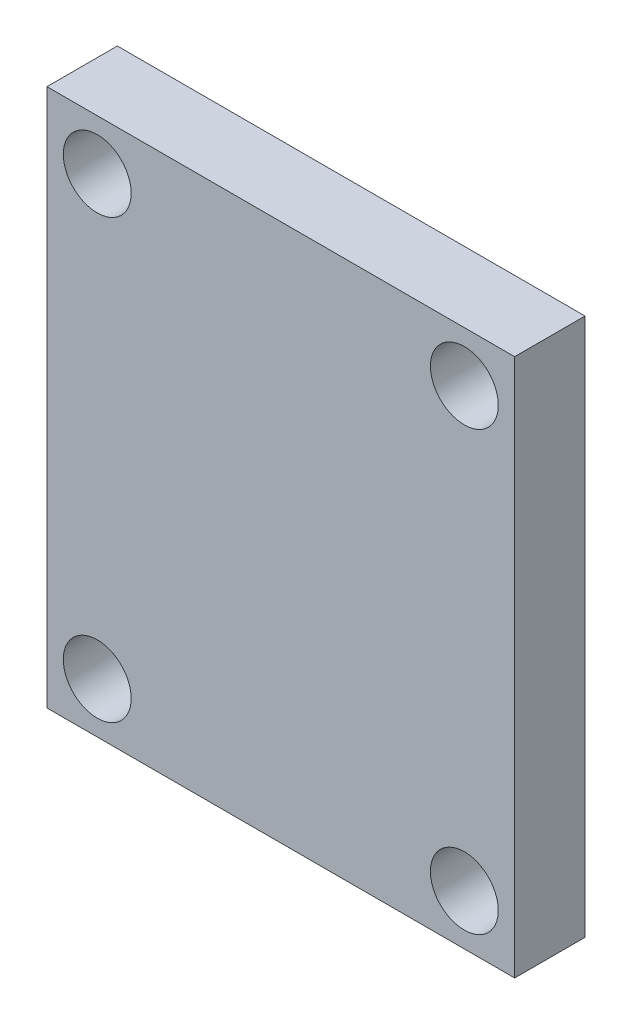
ISO-10303-21;
HEADER;
FILE_DESCRIPTION(('STEP AP214'),'2;1');
FILE_NAME('part.step','',(''),(''),'','','');
FILE_SCHEMA(('AUTOMOTIVE_DESIGN { 1 0 10303 214 1 1 1 1 }'));
ENDSEC;
DATA;
#1=APPLICATION_CONTEXT('core data for automotive mechanical design processes');
#2=APPLICATION_PROTOCOL_DEFINITION('international standard','automotive_design',2000,#1);
#3=PRODUCT_CONTEXT('',#1,'mechanical');
#4=PRODUCT('Part','Part','',(#3));
#5=PRODUCT_RELATED_PRODUCT_CATEGORY('part','',(#4));
#6=PRODUCT_DEFINITION_FORMATION('','',#4);
#7=PRODUCT_DEFINITION_CONTEXT('part definition',#1,'design');
#8=PRODUCT_DEFINITION('design','',#6,#7);
#9=PRODUCT_DEFINITION_SHAPE('','',#8);
#10=(LENGTH_UNIT() NAMED_UNIT(*) SI_UNIT(.MILLI.,.METRE.));
#11=(NAMED_UNIT(*) PLANE_ANGLE_UNIT() SI_UNIT($,.RADIAN.));
#12=(NAMED_UNIT(*) SI_UNIT($,.STERADIAN.) SOLID_ANGLE_UNIT());
#13=UNCERTAINTY_MEASURE_WITH_UNIT(LENGTH_MEASURE(1.E-05),#10,'distance_accuracy_value','');
#14=(GEOMETRIC_REPRESENTATION_CONTEXT(3) GLOBAL_UNCERTAINTY_ASSIGNED_CONTEXT((#13)) GLOBAL_UNIT_ASSIGNED_CONTEXT((#10,
#11,#12)) REPRESENTATION_CONTEXT('',''));
#15=CARTESIAN_POINT('',(0.,0.,0.));
#16=DIRECTION('',(0.,0.,1.));
#17=DIRECTION('',(1.,0.,0.));
#18=AXIS2_PLACEMENT_3D('',#15,#16,#17);
#19=CARTESIAN_POINT('',(46.5,-53.5,14.));
#20=DIRECTION('',(-1.,0.,0.));
#21=DIRECTION('',(0.,0.,1.));
#22=AXIS2_PLACEMENT_3D('',#19,#20,#21);
#23=PLANE('',#22);
#24=DIRECTION('',(0.,1.,0.));
#25=VECTOR('',#24,1.);
#26=CARTESIAN_POINT('',(46.5,-53.5,0.));
#27=LINE('',#26,#25);
#28=CARTESIAN_POINT('',(46.5,-53.5,0.));
#29=VERTEX_POINT('',#28);
#30=CARTESIAN_POINT('',(46.5,53.5,0.));
#31=VERTEX_POINT('',#30);
#32=EDGE_CURVE('E174',#29,#31,#27,.T.);
#33=ORIENTED_EDGE('',*,*,#32,.T.);
#34=DIRECTION('',(0.,0.,-1.));
#35=VECTOR('',#34,1.);
#36=CARTESIAN_POINT('',(46.5,53.5,14.));
#37=LINE('',#36,#35);
#38=CARTESIAN_POINT('',(46.5,53.5,14.));
#39=VERTEX_POINT('',#38);
#40=EDGE_CURVE('E11',#39,#31,#37,.T.);
#41=ORIENTED_EDGE('',*,*,#40,.F.);
#42=DIRECTION('',(0.,1.,0.));
#43=VECTOR('',#42,1.);
#44=CARTESIAN_POINT('',(46.5,-53.5,14.));
#45=LINE('',#44,#43);
#46=CARTESIAN_POINT('',(46.5,-53.5,14.));
#47=VERTEX_POINT('',#46);
#48=EDGE_CURVE('E177',#47,#39,#45,.T.);
#49=ORIENTED_EDGE('',*,*,#48,.F.);
#50=DIRECTION('',(0.,0.,-1.));
#51=VECTOR('',#50,1.);
#52=CARTESIAN_POINT('',(46.5,-53.5,14.));
#53=LINE('',#52,#51);
#54=EDGE_CURVE('E183',#47,#29,#53,.T.);
#55=ORIENTED_EDGE('',*,*,#54,.T.);
#56=EDGE_LOOP('',(#33,#41,#49,#55));
#57=FACE_BOUND('',#56,.T.);
#58=ADVANCED_FACE('F41',(#57),#23,.F.);
#59=CARTESIAN_POINT('',(-46.5,53.5,14.));
#60=DIRECTION('',(0.,-1.,0.));
#61=DIRECTION('',(0.,0.,-1.));
#62=AXIS2_PLACEMENT_3D('',#59,#60,#61);
#63=PLANE('',#62);
#64=DIRECTION('',(-1.,0.,0.));
#65=VECTOR('',#64,1.);
#66=CARTESIAN_POINT('',(-46.5,53.5,0.));
#67=LINE('',#66,#65);
#68=CARTESIAN_POINT('',(-46.5,53.5,0.));
#69=VERTEX_POINT('',#68);
#70=EDGE_CURVE('E186',#31,#69,#67,.T.);
#71=ORIENTED_EDGE('',*,*,#70,.T.);
#72=DIRECTION('',(0.,0.,-1.));
#73=VECTOR('',#72,1.);
#74=CARTESIAN_POINT('',(-46.5,53.5,14.));
#75=LINE('',#74,#73);
#76=CARTESIAN_POINT('',(-46.5,53.5,14.));
#77=VERTEX_POINT('',#76);
#78=EDGE_CURVE('E48',#77,#69,#75,.T.);
#79=ORIENTED_EDGE('',*,*,#78,.F.);
#80=DIRECTION('',(-1.,0.,0.));
#81=VECTOR('',#80,1.);
#82=CARTESIAN_POINT('',(-46.5,53.5,14.));
#83=LINE('',#82,#81);
#84=EDGE_CURVE('E92',#39,#77,#83,.T.);
#85=ORIENTED_EDGE('',*,*,#84,.F.);
#86=ORIENTED_EDGE('',*,*,#40,.T.);
#87=EDGE_LOOP('',(#71,#79,#85,#86));
#88=FACE_BOUND('',#87,.T.);
#89=ADVANCED_FACE('F215',(#88),#63,.F.);
#90=CARTESIAN_POINT('',(-46.5,-53.5,14.));
#91=DIRECTION('',(1.,0.,0.));
#92=DIRECTION('',(0.,0.,-1.));
#93=AXIS2_PLACEMENT_3D('',#90,#91,#92);
#94=PLANE('',#93);
#95=DIRECTION('',(0.,-1.,0.));
#96=VECTOR('',#95,1.);
#97=CARTESIAN_POINT('',(-46.5,-53.5,0.));
#98=LINE('',#97,#96);
#99=CARTESIAN_POINT('',(-46.5,-53.5,0.));
#100=VERTEX_POINT('',#99);
#101=EDGE_CURVE('E188',#69,#100,#98,.T.);
#102=ORIENTED_EDGE('',*,*,#101,.T.);
#103=DIRECTION('',(0.,0.,-1.));
#104=VECTOR('',#103,1.);
#105=CARTESIAN_POINT('',(-46.5,-53.5,14.));
#106=LINE('',#105,#104);
#107=CARTESIAN_POINT('',(-46.5,-53.5,14.));
#108=VERTEX_POINT('',#107);
#109=EDGE_CURVE('E192',#108,#100,#106,.T.);
#110=ORIENTED_EDGE('',*,*,#109,.F.);
#111=DIRECTION('',(0.,-1.,0.));
#112=VECTOR('',#111,1.);
#113=CARTESIAN_POINT('',(-46.5,-53.5,14.));
#114=LINE('',#113,#112);
#115=EDGE_CURVE('E180',#77,#108,#114,.T.);
#116=ORIENTED_EDGE('',*,*,#115,.F.);
#117=ORIENTED_EDGE('',*,*,#78,.T.);
#118=EDGE_LOOP('',(#102,#110,#116,#117));
#119=FACE_BOUND('',#118,.T.);
#120=ADVANCED_FACE('F197',(#119),#94,.F.);
#121=CARTESIAN_POINT('',(-46.5,-53.5,14.));
#122=DIRECTION('',(0.,1.,0.));
#123=DIRECTION('',(0.,0.,1.));
#124=AXIS2_PLACEMENT_3D('',#121,#122,#123);
#125=PLANE('',#124);
#126=DIRECTION('',(1.,0.,0.));
#127=VECTOR('',#126,1.);
#128=CARTESIAN_POINT('',(-46.5,-53.5,0.));
#129=LINE('',#128,#127);
#130=EDGE_CURVE('E85',#100,#29,#129,.T.);
#131=ORIENTED_EDGE('',*,*,#130,.T.);
#132=ORIENTED_EDGE('',*,*,#54,.F.);
#133=DIRECTION('',(1.,0.,0.));
#134=VECTOR('',#133,1.);
#135=CARTESIAN_POINT('',(-46.5,-53.5,14.));
#136=LINE('',#135,#134);
#137=EDGE_CURVE('E64',#108,#47,#136,.T.);
#138=ORIENTED_EDGE('',*,*,#137,.F.);
#139=ORIENTED_EDGE('',*,*,#109,.T.);
#140=EDGE_LOOP('',(#131,#132,#138,#139));
#141=FACE_BOUND('',#140,.T.);
#142=ADVANCED_FACE('F205',(#141),#125,.F.);
#143=CARTESIAN_POINT('',(0.,0.,14.));
#144=DIRECTION('',(0.,0.,-1.));
#145=DIRECTION('',(-1.,0.,0.));
#146=AXIS2_PLACEMENT_3D('',#143,#144,#145);
#147=PLANE('',#146);
#148=CARTESIAN_POINT('',(36.5,-43.5,14.));
#149=DIRECTION('',(0.,0.,-1.));
#150=DIRECTION('',(-1.,0.,0.));
#151=AXIS2_PLACEMENT_3D('',#148,#149,#150);
#152=CIRCLE('',#151,6.75);
#153=CARTESIAN_POINT('',(29.75,-43.5,14.));
#154=VERTEX_POINT('',#153);
#155=EDGE_CURVE('E149',#154,#154,#152,.T.);
#156=ORIENTED_EDGE('',*,*,#155,.T.);
#157=EDGE_LOOP('',(#156));
#158=FACE_BOUND('',#157,.T.);
#159=CARTESIAN_POINT('',(-36.5,-43.5,14.));
#160=DIRECTION('',(0.,0.,-1.));
#161=DIRECTION('',(-1.,0.,0.));
#162=AXIS2_PLACEMENT_3D('',#159,#160,#161);
#163=CIRCLE('',#162,6.75);
#164=CARTESIAN_POINT('',(-43.25,-43.5,14.));
#165=VERTEX_POINT('',#164);
#166=EDGE_CURVE('E163',#165,#165,#163,.T.);
#167=ORIENTED_EDGE('',*,*,#166,.T.);
#168=EDGE_LOOP('',(#167));
#169=FACE_BOUND('',#168,.T.);
#170=CARTESIAN_POINT('',(-36.5,43.5,14.));
#171=DIRECTION('',(0.,0.,-1.));
#172=DIRECTION('',(-1.,0.,0.));
#173=AXIS2_PLACEMENT_3D('',#170,#171,#172);
#174=CIRCLE('',#173,6.75);
#175=CARTESIAN_POINT('',(-43.25,43.5,14.));
#176=VERTEX_POINT('',#175);
#177=EDGE_CURVE('E157',#176,#176,#174,.T.);
#178=ORIENTED_EDGE('',*,*,#177,.T.);
#179=EDGE_LOOP('',(#178));
#180=FACE_BOUND('',#179,.T.);
#181=CARTESIAN_POINT('',(36.5,43.5,14.));
#182=DIRECTION('',(0.,0.,-1.));
#183=DIRECTION('',(-1.,0.,0.));
#184=AXIS2_PLACEMENT_3D('',#181,#182,#183);
#185=CIRCLE('',#184,6.75);
#186=CARTESIAN_POINT('',(29.75,43.5,14.));
#187=VERTEX_POINT('',#186);
#188=EDGE_CURVE('E171',#187,#187,#185,.T.);
#189=ORIENTED_EDGE('',*,*,#188,.T.);
#190=EDGE_LOOP('',(#189));
#191=FACE_BOUND('',#190,.T.);
#192=ORIENTED_EDGE('',*,*,#48,.T.);
#193=ORIENTED_EDGE('',*,*,#84,.T.);
#194=ORIENTED_EDGE('',*,*,#115,.T.);
#195=ORIENTED_EDGE('',*,*,#137,.T.);
#196=EDGE_LOOP('',(#192,#193,#194,#195));
#197=FACE_BOUND('',#196,.T.);
#198=ADVANCED_FACE('F207',(#158,#169,#180,#191,#197),#147,.F.);
#199=CARTESIAN_POINT('',(0.,0.,0.));
#200=DIRECTION('',(0.,0.,-1.));
#201=DIRECTION('',(-1.,0.,0.));
#202=AXIS2_PLACEMENT_3D('',#199,#200,#201);
#203=PLANE('',#202);
#204=DIRECTION('',(0.,1.,0.));
#205=VECTOR('',#204,1.);
#206=CARTESIAN_POINT('',(-37.5,-26.5,0.));
#207=LINE('',#206,#205);
#208=CARTESIAN_POINT('',(-37.5,-26.5,0.));
#209=VERTEX_POINT('',#208);
#210=CARTESIAN_POINT('',(-37.5,26.5,0.));
#211=VERTEX_POINT('',#210);
#212=EDGE_CURVE('E55',#209,#211,#207,.T.);
#213=ORIENTED_EDGE('',*,*,#212,.F.);
#214=DIRECTION('',(-1.,0.,0.));
#215=VECTOR('',#214,1.);
#216=CARTESIAN_POINT('',(37.5,-26.5,0.));
#217=LINE('',#216,#215);
#218=CARTESIAN_POINT('',(37.5,-26.5,0.));
#219=VERTEX_POINT('',#218);
#220=EDGE_CURVE('E134',#219,#209,#217,.T.);
#221=ORIENTED_EDGE('',*,*,#220,.F.);
#222=DIRECTION('',(0.,-1.,0.));
#223=VECTOR('',#222,1.);
#224=CARTESIAN_POINT('',(37.5,-26.5,0.));
#225=LINE('',#224,#223);
#226=CARTESIAN_POINT('',(37.5,26.5,0.));
#227=VERTEX_POINT('',#226);
#228=EDGE_CURVE('E137',#227,#219,#225,.T.);
#229=ORIENTED_EDGE('',*,*,#228,.F.);
#230=DIRECTION('',(1.,0.,0.));
#231=VECTOR('',#230,1.);
#232=CARTESIAN_POINT('',(37.5,26.5,0.));
#233=LINE('',#232,#231);
#234=EDGE_CURVE('E143',#211,#227,#233,.T.);
#235=ORIENTED_EDGE('',*,*,#234,.F.);
#236=EDGE_LOOP('',(#213,#221,#229,#235));
#237=FACE_BOUND('',#236,.T.);
#238=CARTESIAN_POINT('',(36.5,-43.5,0.));
#239=DIRECTION('',(0.,0.,-1.));
#240=DIRECTION('',(-1.,0.,0.));
#241=AXIS2_PLACEMENT_3D('',#238,#239,#240);
#242=CIRCLE('',#241,6.75);
#243=CARTESIAN_POINT('',(29.75,-43.5,0.));
#244=VERTEX_POINT('',#243);
#245=EDGE_CURVE('E166',#244,#244,#242,.T.);
#246=ORIENTED_EDGE('',*,*,#245,.F.);
#247=EDGE_LOOP('',(#246));
#248=FACE_BOUND('',#247,.T.);
#249=CARTESIAN_POINT('',(-36.5,-43.5,0.));
#250=DIRECTION('',(0.,0.,-1.));
#251=DIRECTION('',(-1.,0.,0.));
#252=AXIS2_PLACEMENT_3D('',#249,#250,#251);
#253=CIRCLE('',#252,6.75);
#254=CARTESIAN_POINT('',(-43.25,-43.5,0.));
#255=VERTEX_POINT('',#254);
#256=EDGE_CURVE('E160',#255,#255,#253,.T.);
#257=ORIENTED_EDGE('',*,*,#256,.F.);
#258=EDGE_LOOP('',(#257));
#259=FACE_BOUND('',#258,.T.);
#260=CARTESIAN_POINT('',(-36.5,43.5,0.));
#261=DIRECTION('',(0.,0.,-1.));
#262=DIRECTION('',(-1.,0.,0.));
#263=AXIS2_PLACEMENT_3D('',#260,#261,#262);
#264=CIRCLE('',#263,6.75);
#265=CARTESIAN_POINT('',(-43.25,43.5,0.));
#266=VERTEX_POINT('',#265);
#267=EDGE_CURVE('E153',#266,#266,#264,.T.);
#268=ORIENTED_EDGE('',*,*,#267,.F.);
#269=EDGE_LOOP('',(#268));
#270=FACE_BOUND('',#269,.T.);
#271=CARTESIAN_POINT('',(36.5,43.5,0.));
#272=DIRECTION('',(0.,0.,-1.));
#273=DIRECTION('',(-1.,0.,0.));
#274=AXIS2_PLACEMENT_3D('',#271,#272,#273);
#275=CIRCLE('',#274,6.75);
#276=CARTESIAN_POINT('',(29.75,43.5,0.));
#277=VERTEX_POINT('',#276);
#278=EDGE_CURVE('E156',#277,#277,#275,.T.);
#279=ORIENTED_EDGE('',*,*,#278,.F.);
#280=EDGE_LOOP('',(#279));
#281=FACE_BOUND('',#280,.T.);
#282=ORIENTED_EDGE('',*,*,#32,.F.);
#283=ORIENTED_EDGE('',*,*,#130,.F.);
#284=ORIENTED_EDGE('',*,*,#101,.F.);
#285=ORIENTED_EDGE('',*,*,#70,.F.);
#286=EDGE_LOOP('',(#282,#283,#284,#285));
#287=FACE_BOUND('',#286,.T.);
#288=ADVANCED_FACE('F201',(#237,#248,#259,#270,#281,#287),#203,.T.);
#289=CARTESIAN_POINT('',(36.5,43.5,14.));
#290=DIRECTION('',(0.,0.,-1.));
#291=DIRECTION('',(-1.,0.,0.));
#292=AXIS2_PLACEMENT_3D('',#289,#290,#291);
#293=CYLINDRICAL_SURFACE('',#292,6.75);
#294=ORIENTED_EDGE('',*,*,#188,.F.);
#295=EDGE_LOOP('',(#294));
#296=FACE_BOUND('',#295,.T.);
#297=ORIENTED_EDGE('',*,*,#278,.T.);
#298=EDGE_LOOP('',(#297));
#299=FACE_BOUND('',#298,.T.);
#300=ADVANCED_FACE('F248',(#296,#299),#293,.F.);
#301=CARTESIAN_POINT('',(-36.5,43.5,14.));
#302=DIRECTION('',(0.,0.,-1.));
#303=DIRECTION('',(-1.,0.,0.));
#304=AXIS2_PLACEMENT_3D('',#301,#302,#303);
#305=CYLINDRICAL_SURFACE('',#304,6.75);
#306=ORIENTED_EDGE('',*,*,#177,.F.);
#307=EDGE_LOOP('',(#306));
#308=FACE_BOUND('',#307,.T.);
#309=ORIENTED_EDGE('',*,*,#267,.T.);
#310=EDGE_LOOP('',(#309));
#311=FACE_BOUND('',#310,.T.);
#312=ADVANCED_FACE('F253',(#308,#311),#305,.F.);
#313=CARTESIAN_POINT('',(-36.5,-43.5,14.));
#314=DIRECTION('',(0.,0.,-1.));
#315=DIRECTION('',(-1.,0.,0.));
#316=AXIS2_PLACEMENT_3D('',#313,#314,#315);
#317=CYLINDRICAL_SURFACE('',#316,6.75);
#318=ORIENTED_EDGE('',*,*,#166,.F.);
#319=EDGE_LOOP('',(#318));
#320=FACE_BOUND('',#319,.T.);
#321=ORIENTED_EDGE('',*,*,#256,.T.);
#322=EDGE_LOOP('',(#321));
#323=FACE_BOUND('',#322,.T.);
#324=ADVANCED_FACE('F264',(#320,#323),#317,.F.);
#325=CARTESIAN_POINT('',(36.5,-43.5,14.));
#326=DIRECTION('',(0.,0.,-1.));
#327=DIRECTION('',(-1.,0.,0.));
#328=AXIS2_PLACEMENT_3D('',#325,#326,#327);
#329=CYLINDRICAL_SURFACE('',#328,6.75);
#330=ORIENTED_EDGE('',*,*,#155,.F.);
#331=EDGE_LOOP('',(#330));
#332=FACE_BOUND('',#331,.T.);
#333=ORIENTED_EDGE('',*,*,#245,.T.);
#334=EDGE_LOOP('',(#333));
#335=FACE_BOUND('',#334,.T.);
#336=ADVANCED_FACE('F275',(#332,#335),#329,.F.);
#337=CARTESIAN_POINT('',(-37.5,-26.5,0.0001));
#338=DIRECTION('',(-1.,0.,0.));
#339=DIRECTION('',(0.,0.,1.));
#340=AXIS2_PLACEMENT_3D('',#337,#338,#339);
#341=PLANE('',#340);
#342=ORIENTED_EDGE('',*,*,#212,.T.);
#343=DIRECTION('',(0.,0.,-1.));
#344=VECTOR('',#343,1.);
#345=CARTESIAN_POINT('',(-37.5,26.5,0.0001));
#346=LINE('',#345,#344);
#347=CARTESIAN_POINT('',(-37.5,26.5,0.0001));
#348=VERTEX_POINT('',#347);
#349=EDGE_CURVE('E112',#348,#211,#346,.T.);
#350=ORIENTED_EDGE('',*,*,#349,.F.);
#351=DIRECTION('',(0.,1.,0.));
#352=VECTOR('',#351,1.);
#353=CARTESIAN_POINT('',(-37.5,-26.5,0.0001));
#354=LINE('',#353,#352);
#355=CARTESIAN_POINT('',(-37.5,-26.5,0.0001));
#356=VERTEX_POINT('',#355);
#357=EDGE_CURVE('E116',#356,#348,#354,.T.);
#358=ORIENTED_EDGE('',*,*,#357,.F.);
#359=DIRECTION('',(0.,0.,-1.));
#360=VECTOR('',#359,1.);
#361=CARTESIAN_POINT('',(-37.5,-26.5,0.0001));
#362=LINE('',#361,#360);
#363=EDGE_CURVE('E147',#356,#209,#362,.T.);
#364=ORIENTED_EDGE('',*,*,#363,.T.);
#365=EDGE_LOOP('',(#342,#350,#358,#364));
#366=FACE_BOUND('',#365,.T.);
#367=ADVANCED_FACE('F114',(#366),#341,.F.);
#368=CARTESIAN_POINT('',(37.5,-26.5,0.0001));
#369=DIRECTION('',(0.,-1.,0.));
#370=DIRECTION('',(0.,0.,-1.));
#371=AXIS2_PLACEMENT_3D('',#368,#369,#370);
#372=PLANE('',#371);
#373=ORIENTED_EDGE('',*,*,#220,.T.);
#374=ORIENTED_EDGE('',*,*,#363,.F.);
#375=DIRECTION('',(-1.,0.,0.));
#376=VECTOR('',#375,1.);
#377=CARTESIAN_POINT('',(37.5,-26.5,0.0001));
#378=LINE('',#377,#376);
#379=CARTESIAN_POINT('',(37.5,-26.5,0.0001));
#380=VERTEX_POINT('',#379);
#381=EDGE_CURVE('E122',#380,#356,#378,.T.);
#382=ORIENTED_EDGE('',*,*,#381,.F.);
#383=DIRECTION('',(0.,0.,-1.));
#384=VECTOR('',#383,1.);
#385=CARTESIAN_POINT('',(37.5,-26.5,0.0001));
#386=LINE('',#385,#384);
#387=EDGE_CURVE('E150',#380,#219,#386,.T.);
#388=ORIENTED_EDGE('',*,*,#387,.T.);
#389=EDGE_LOOP('',(#373,#374,#382,#388));
#390=FACE_BOUND('',#389,.T.);
#391=ADVANCED_FACE('F303',(#390),#372,.F.);
#392=CARTESIAN_POINT('',(37.5,-26.5,0.0001));
#393=DIRECTION('',(1.,0.,0.));
#394=DIRECTION('',(0.,0.,-1.));
#395=AXIS2_PLACEMENT_3D('',#392,#393,#394);
#396=PLANE('',#395);
#397=ORIENTED_EDGE('',*,*,#228,.T.);
#398=ORIENTED_EDGE('',*,*,#387,.F.);
#399=DIRECTION('',(0.,-1.,0.));
#400=VECTOR('',#399,1.);
#401=CARTESIAN_POINT('',(37.5,-26.5,0.0001));
#402=LINE('',#401,#400);
#403=CARTESIAN_POINT('',(37.5,26.5,0.0001));
#404=VERTEX_POINT('',#403);
#405=EDGE_CURVE('E130',#404,#380,#402,.T.);
#406=ORIENTED_EDGE('',*,*,#405,.F.);
#407=DIRECTION('',(0.,0.,-1.));
#408=VECTOR('',#407,1.);
#409=CARTESIAN_POINT('',(37.5,26.5,0.0001));
#410=LINE('',#409,#408);
#411=EDGE_CURVE('E121',#404,#227,#410,.T.);
#412=ORIENTED_EDGE('',*,*,#411,.T.);
#413=EDGE_LOOP('',(#397,#398,#406,#412));
#414=FACE_BOUND('',#413,.T.);
#415=ADVANCED_FACE('F313',(#414),#396,.F.);
#416=CARTESIAN_POINT('',(37.5,26.5,0.0001));
#417=DIRECTION('',(0.,1.,0.));
#418=DIRECTION('',(0.,0.,1.));
#419=AXIS2_PLACEMENT_3D('',#416,#417,#418);
#420=PLANE('',#419);
#421=ORIENTED_EDGE('',*,*,#234,.T.);
#422=ORIENTED_EDGE('',*,*,#411,.F.);
#423=DIRECTION('',(1.,0.,0.));
#424=VECTOR('',#423,1.);
#425=CARTESIAN_POINT('',(37.5,26.5,0.0001));
#426=LINE('',#425,#424);
#427=EDGE_CURVE('E125',#348,#404,#426,.T.);
#428=ORIENTED_EDGE('',*,*,#427,.F.);
#429=ORIENTED_EDGE('',*,*,#349,.T.);
#430=EDGE_LOOP('',(#421,#422,#428,#429));
#431=FACE_BOUND('',#430,.T.);
#432=ADVANCED_FACE('F126',(#431),#420,.F.);
#433=CARTESIAN_POINT('',(0.,0.,0.0001));
#434=DIRECTION('',(0.,0.,1.));
#435=DIRECTION('',(1.,0.,0.));
#436=AXIS2_PLACEMENT_3D('',#433,#434,#435);
#437=PLANE('',#436);
#438=ORIENTED_EDGE('',*,*,#357,.T.);
#439=ORIENTED_EDGE('',*,*,#427,.T.);
#440=ORIENTED_EDGE('',*,*,#405,.T.);
#441=ORIENTED_EDGE('',*,*,#381,.T.);
#442=EDGE_LOOP('',(#438,#439,#440,#441));
#443=FACE_BOUND('',#442,.T.);
#444=ADVANCED_FACE('F132',(#443),#437,.F.);
#445=CLOSED_SHELL('',(#58,#89,#120,#142,#198,#288,#300,#312,#324,#336,#367,#391,#415,#432,#444));
#446=MANIFOLD_SOLID_BREP('B2',#445);
#447=ADVANCED_BREP_SHAPE_REPRESENTATION('',(#18,#446),#14);
#448=SHAPE_DEFINITION_REPRESENTATION(#9,#447);
ENDSEC;
END-ISO-10303-21;
